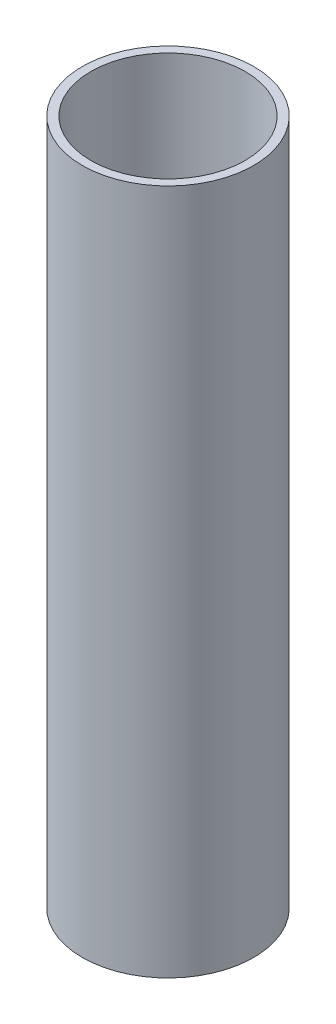
ISO-10303-21;
HEADER;
FILE_DESCRIPTION(('STEP AP214'),'2;1');
FILE_NAME('part.step','',(''),(''),'','','');
FILE_SCHEMA(('AUTOMOTIVE_DESIGN { 1 0 10303 214 1 1 1 1 }'));
ENDSEC;
DATA;
#1=APPLICATION_CONTEXT('core data for automotive mechanical design processes');
#2=APPLICATION_PROTOCOL_DEFINITION('international standard','automotive_design',2000,#1);
#3=PRODUCT_CONTEXT('',#1,'mechanical');
#4=PRODUCT('Part','Part','',(#3));
#5=PRODUCT_RELATED_PRODUCT_CATEGORY('part','',(#4));
#6=PRODUCT_DEFINITION_FORMATION('','',#4);
#7=PRODUCT_DEFINITION_CONTEXT('part definition',#1,'design');
#8=PRODUCT_DEFINITION('design','',#6,#7);
#9=PRODUCT_DEFINITION_SHAPE('','',#8);
#10=(LENGTH_UNIT() NAMED_UNIT(*) SI_UNIT(.MILLI.,.METRE.));
#11=(NAMED_UNIT(*) PLANE_ANGLE_UNIT() SI_UNIT($,.RADIAN.));
#12=(NAMED_UNIT(*) SI_UNIT($,.STERADIAN.) SOLID_ANGLE_UNIT());
#13=UNCERTAINTY_MEASURE_WITH_UNIT(LENGTH_MEASURE(1.E-05),#10,'distance_accuracy_value','');
#14=(GEOMETRIC_REPRESENTATION_CONTEXT(3) GLOBAL_UNCERTAINTY_ASSIGNED_CONTEXT((#13)) GLOBAL_UNIT_ASSIGNED_CONTEXT((#10,
#11,#12)) REPRESENTATION_CONTEXT('',''));
#15=CARTESIAN_POINT('',(0.,0.,0.));
#16=DIRECTION('',(0.,0.,1.));
#17=DIRECTION('',(1.,0.,0.));
#18=AXIS2_PLACEMENT_3D('',#15,#16,#17);
#19=CARTESIAN_POINT('',(0.,400.,0.));
#20=DIRECTION('',(0.,1.,0.));
#21=DIRECTION('',(0.,0.,1.));
#22=AXIS2_PLACEMENT_3D('',#19,#20,#21);
#23=PLANE('',#22);
#24=CARTESIAN_POINT('',(0.,400.,0.));
#25=DIRECTION('',(0.,1.,0.));
#26=DIRECTION('',(0.,0.,1.));
#27=AXIS2_PLACEMENT_3D('',#24,#25,#26);
#28=CIRCLE('',#27,50.);
#29=CARTESIAN_POINT('',(0.,400.,50.));
#30=VERTEX_POINT('',#29);
#31=EDGE_CURVE('E10',#30,#30,#28,.T.);
#32=ORIENTED_EDGE('',*,*,#31,.T.);
#33=EDGE_LOOP('',(#32));
#34=FACE_BOUND('',#33,.T.);
#35=CARTESIAN_POINT('',(0.,400.,0.));
#36=DIRECTION('',(0.,1.,0.));
#37=DIRECTION('',(0.,0.,1.));
#38=AXIS2_PLACEMENT_3D('',#35,#36,#37);
#39=CIRCLE('',#38,45.);
#40=CARTESIAN_POINT('',(0.,400.,45.));
#41=VERTEX_POINT('',#40);
#42=EDGE_CURVE('E50',#41,#41,#39,.T.);
#43=ORIENTED_EDGE('',*,*,#42,.F.);
#44=EDGE_LOOP('',(#43));
#45=FACE_BOUND('',#44,.T.);
#46=ADVANCED_FACE('F37',(#34,#45),#23,.T.);
#47=CARTESIAN_POINT('',(0.,0.,0.));
#48=DIRECTION('',(0.,1.,0.));
#49=DIRECTION('',(0.,0.,1.));
#50=AXIS2_PLACEMENT_3D('',#47,#48,#49);
#51=PLANE('',#50);
#52=CARTESIAN_POINT('',(0.,0.,0.));
#53=DIRECTION('',(0.,1.,0.));
#54=DIRECTION('',(0.,0.,1.));
#55=AXIS2_PLACEMENT_3D('',#52,#53,#54);
#56=CIRCLE('',#55,50.);
#57=CARTESIAN_POINT('',(0.,0.,50.));
#58=VERTEX_POINT('',#57);
#59=EDGE_CURVE('E41',#58,#58,#56,.T.);
#60=ORIENTED_EDGE('',*,*,#59,.F.);
#61=EDGE_LOOP('',(#60));
#62=FACE_BOUND('',#61,.T.);
#63=CARTESIAN_POINT('',(0.,0.,0.));
#64=DIRECTION('',(0.,1.,0.));
#65=DIRECTION('',(0.,0.,1.));
#66=AXIS2_PLACEMENT_3D('',#63,#64,#65);
#67=CIRCLE('',#66,45.);
#68=CARTESIAN_POINT('',(0.,0.,45.));
#69=VERTEX_POINT('',#68);
#70=EDGE_CURVE('E52',#69,#69,#67,.T.);
#71=ORIENTED_EDGE('',*,*,#70,.T.);
#72=EDGE_LOOP('',(#71));
#73=FACE_BOUND('',#72,.T.);
#74=ADVANCED_FACE('F64',(#62,#73),#51,.F.);
#75=CARTESIAN_POINT('',(0.,400.,0.));
#76=DIRECTION('',(0.,-1.,0.));
#77=DIRECTION('',(0.,0.,-1.));
#78=AXIS2_PLACEMENT_3D('',#75,#76,#77);
#79=CYLINDRICAL_SURFACE('',#78,50.);
#80=ORIENTED_EDGE('',*,*,#31,.F.);
#81=EDGE_LOOP('',(#80));
#82=FACE_BOUND('',#81,.T.);
#83=ORIENTED_EDGE('',*,*,#59,.T.);
#84=EDGE_LOOP('',(#83));
#85=FACE_BOUND('',#84,.T.);
#86=ADVANCED_FACE('F39',(#82,#85),#79,.T.);
#87=CARTESIAN_POINT('',(0.,400.,0.));
#88=DIRECTION('',(0.,-1.,0.));
#89=DIRECTION('',(0.,0.,-1.));
#90=AXIS2_PLACEMENT_3D('',#87,#88,#89);
#91=CYLINDRICAL_SURFACE('',#90,45.);
#92=ORIENTED_EDGE('',*,*,#42,.T.);
#93=EDGE_LOOP('',(#92));
#94=FACE_BOUND('',#93,.T.);
#95=ORIENTED_EDGE('',*,*,#70,.F.);
#96=EDGE_LOOP('',(#95));
#97=FACE_BOUND('',#96,.T.);
#98=ADVANCED_FACE('F60',(#94,#97),#91,.F.);
#99=CLOSED_SHELL('',(#46,#74,#86,#98));
#100=MANIFOLD_SOLID_BREP('B2',#99);
#101=ADVANCED_BREP_SHAPE_REPRESENTATION('',(#18,#100),#14);
#102=SHAPE_DEFINITION_REPRESENTATION(#9,#101);
ENDSEC;
END-ISO-10303-21;
